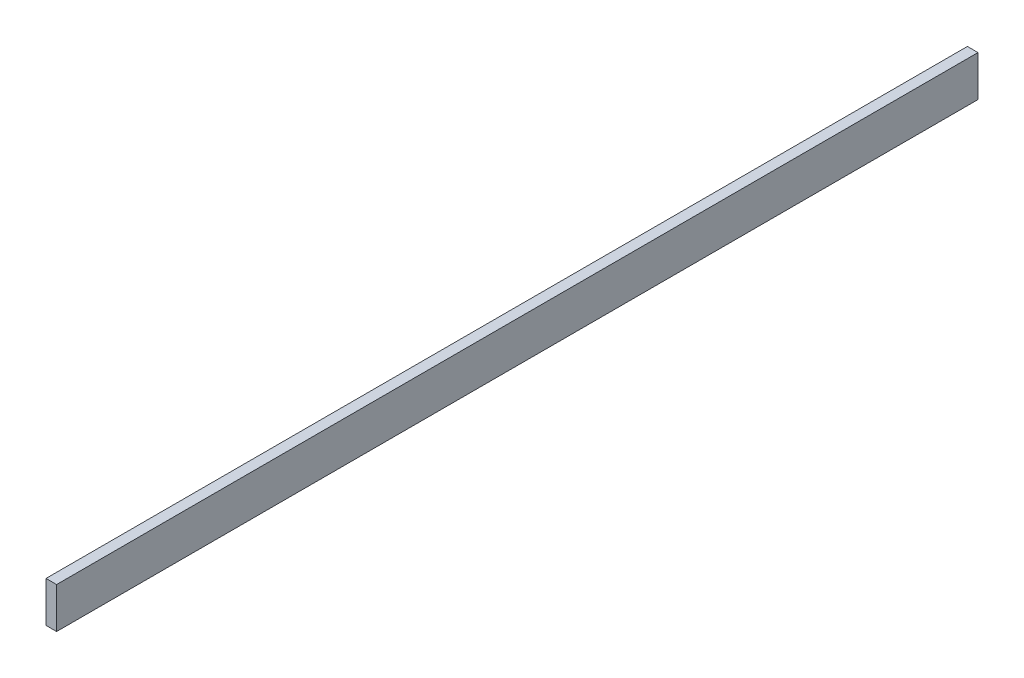
ISO-10303-21;
HEADER;
FILE_DESCRIPTION(('STEP AP214'),'2;1');
FILE_NAME('part.step','',(''),(''),'','','');
FILE_SCHEMA(('AUTOMOTIVE_DESIGN { 1 0 10303 214 1 1 1 1 }'));
ENDSEC;
DATA;
#1=APPLICATION_CONTEXT('core data for automotive mechanical design processes');
#2=APPLICATION_PROTOCOL_DEFINITION('international standard','automotive_design',2000,#1);
#3=PRODUCT_CONTEXT('',#1,'mechanical');
#4=PRODUCT('Part','Part','',(#3));
#5=PRODUCT_RELATED_PRODUCT_CATEGORY('part','',(#4));
#6=PRODUCT_DEFINITION_FORMATION('','',#4);
#7=PRODUCT_DEFINITION_CONTEXT('part definition',#1,'design');
#8=PRODUCT_DEFINITION('design','',#6,#7);
#9=PRODUCT_DEFINITION_SHAPE('','',#8);
#10=(LENGTH_UNIT() NAMED_UNIT(*) SI_UNIT(.MILLI.,.METRE.));
#11=(NAMED_UNIT(*) PLANE_ANGLE_UNIT() SI_UNIT($,.RADIAN.));
#12=(NAMED_UNIT(*) SI_UNIT($,.STERADIAN.) SOLID_ANGLE_UNIT());
#13=UNCERTAINTY_MEASURE_WITH_UNIT(LENGTH_MEASURE(1.E-05),#10,'distance_accuracy_value','');
#14=(GEOMETRIC_REPRESENTATION_CONTEXT(3) GLOBAL_UNCERTAINTY_ASSIGNED_CONTEXT((#13)) GLOBAL_UNIT_ASSIGNED_CONTEXT((#10,
#11,#12)) REPRESENTATION_CONTEXT('',''));
#15=CARTESIAN_POINT('',(0.,0.,0.));
#16=DIRECTION('',(0.,0.,1.));
#17=DIRECTION('',(1.,0.,0.));
#18=AXIS2_PLACEMENT_3D('',#15,#16,#17);
#19=CARTESIAN_POINT('',(3.88578058618805E-13,-364.261978705734,53.0000000000013));
#20=DIRECTION('',(-1.,0.,0.));
#21=DIRECTION('',(0.,0.,1.));
#22=AXIS2_PLACEMENT_3D('',#19,#20,#21);
#23=PLANE('',#22);
#24=DIRECTION('',(0.,1.,0.));
#25=VECTOR('',#24,1.);
#26=CARTESIAN_POINT('',(3.88578058618805E-13,-364.261978705734,53.0000000000013));
#27=LINE('',#26,#25);
#28=CARTESIAN_POINT('',(1.38777878078145E-13,-15.3827145619995,53.0000000000013));
#29=VERTEX_POINT('',#28);
#30=CARTESIAN_POINT('',(1.38777878078145E-13,0.,53.0000000000013));
#31=VERTEX_POINT('',#30);
#32=EDGE_CURVE('E11',#29,#31,#27,.T.);
#33=ORIENTED_EDGE('',*,*,#32,.F.);
#34=DIRECTION('',(0.,0.,1.));
#35=VECTOR('',#34,1.);
#36=CARTESIAN_POINT('',(1.11022302462516E-13,-15.3827145619995,53.0000000000013));
#37=LINE('',#36,#35);
#38=CARTESIAN_POINT('',(0.,-15.3827145619995,401.000000000002));
#39=VERTEX_POINT('',#38);
#40=EDGE_CURVE('E72',#39,#29,#37,.F.);
#41=ORIENTED_EDGE('',*,*,#40,.F.);
#42=DIRECTION('',(0.,1.,0.));
#43=VECTOR('',#42,1.);
#44=CARTESIAN_POINT('',(2.77555756156289E-13,-364.261978705734,401.000000000002));
#45=LINE('',#44,#43);
#46=CARTESIAN_POINT('',(0.,0.,401.000000000002));
#47=VERTEX_POINT('',#46);
#48=EDGE_CURVE('E35',#39,#47,#45,.T.);
#49=ORIENTED_EDGE('',*,*,#48,.T.);
#50=DIRECTION('',(0.,0.,1.));
#51=VECTOR('',#50,1.);
#52=CARTESIAN_POINT('',(1.38777878078145E-13,0.,53.0000000000013));
#53=LINE('',#52,#51);
#54=EDGE_CURVE('E81',#31,#47,#53,.T.);
#55=ORIENTED_EDGE('',*,*,#54,.F.);
#56=EDGE_LOOP('',(#33,#41,#49,#55));
#57=FACE_BOUND('',#56,.T.);
#58=ADVANCED_FACE('F32',(#57),#23,.T.);
#59=CARTESIAN_POINT('',(3.88578058618805E-13,-364.261978705734,53.0000000000013));
#60=DIRECTION('',(0.,0.,1.));
#61=DIRECTION('',(1.,0.,0.));
#62=AXIS2_PLACEMENT_3D('',#59,#60,#61);
#63=PLANE('',#62);
#64=DIRECTION('',(1.,0.,0.));
#65=VECTOR('',#64,1.);
#66=CARTESIAN_POINT('',(4.00000000000014,-15.3827145619995,53.0000000000013));
#67=LINE('',#66,#65);
#68=CARTESIAN_POINT('',(4.00000000000014,-15.3827145619995,53.0000000000013));
#69=VERTEX_POINT('',#68);
#70=EDGE_CURVE('E74',#69,#29,#67,.F.);
#71=ORIENTED_EDGE('',*,*,#70,.T.);
#72=ORIENTED_EDGE('',*,*,#32,.T.);
#73=DIRECTION('',(1.,0.,0.));
#74=VECTOR('',#73,1.);
#75=CARTESIAN_POINT('',(1.38777878078145E-13,0.,53.0000000000013));
#76=LINE('',#75,#74);
#77=CARTESIAN_POINT('',(4.00000000000009,0.,53.0000000000013));
#78=VERTEX_POINT('',#77);
#79=EDGE_CURVE('E96',#31,#78,#76,.T.);
#80=ORIENTED_EDGE('',*,*,#79,.T.);
#81=DIRECTION('',(0.,1.,0.));
#82=VECTOR('',#81,1.);
#83=CARTESIAN_POINT('',(4.00000000000034,-364.261978705734,53.0000000000013));
#84=LINE('',#83,#82);
#85=EDGE_CURVE('E40',#69,#78,#84,.T.);
#86=ORIENTED_EDGE('',*,*,#85,.F.);
#87=EDGE_LOOP('',(#71,#72,#80,#86));
#88=FACE_BOUND('',#87,.T.);
#89=ADVANCED_FACE('F80',(#88),#63,.F.);
#90=CARTESIAN_POINT('',(4.00000000000034,-364.261978705734,53.0000000000013));
#91=DIRECTION('',(-1.,0.,0.));
#92=DIRECTION('',(0.,0.,1.));
#93=AXIS2_PLACEMENT_3D('',#90,#91,#92);
#94=PLANE('',#93);
#95=DIRECTION('',(0.,0.,-1.));
#96=VECTOR('',#95,1.);
#97=CARTESIAN_POINT('',(4.00000000000014,-15.3827145619995,53.0000000000012));
#98=LINE('',#97,#96);
#99=CARTESIAN_POINT('',(4.00000000000009,-15.3827145619995,401.000000000002));
#100=VERTEX_POINT('',#99);
#101=EDGE_CURVE('E48',#100,#69,#98,.T.);
#102=ORIENTED_EDGE('',*,*,#101,.T.);
#103=ORIENTED_EDGE('',*,*,#85,.T.);
#104=DIRECTION('',(0.,0.,1.));
#105=VECTOR('',#104,1.);
#106=CARTESIAN_POINT('',(4.00000000000009,0.,53.0000000000013));
#107=LINE('',#106,#105);
#108=CARTESIAN_POINT('',(4.00000000000006,0.,401.000000000002));
#109=VERTEX_POINT('',#108);
#110=EDGE_CURVE('E90',#78,#109,#107,.T.);
#111=ORIENTED_EDGE('',*,*,#110,.T.);
#112=DIRECTION('',(0.,1.,0.));
#113=VECTOR('',#112,1.);
#114=CARTESIAN_POINT('',(4.00000000000031,-364.261978705734,401.000000000002));
#115=LINE('',#114,#113);
#116=EDGE_CURVE('E98',#100,#109,#115,.T.);
#117=ORIENTED_EDGE('',*,*,#116,.F.);
#118=EDGE_LOOP('',(#102,#103,#111,#117));
#119=FACE_BOUND('',#118,.T.);
#120=ADVANCED_FACE('F104',(#119),#94,.F.);
#121=CARTESIAN_POINT('',(4.00000000000031,-364.261978705734,401.000000000002));
#122=DIRECTION('',(0.,0.,-1.));
#123=DIRECTION('',(-1.,0.,0.));
#124=AXIS2_PLACEMENT_3D('',#121,#122,#123);
#125=PLANE('',#124);
#126=DIRECTION('',(1.,0.,0.));
#127=VECTOR('',#126,1.);
#128=CARTESIAN_POINT('',(4.00000000000009,-15.3827145619995,401.000000000002));
#129=LINE('',#128,#127);
#130=EDGE_CURVE('E75',#100,#39,#129,.F.);
#131=ORIENTED_EDGE('',*,*,#130,.F.);
#132=ORIENTED_EDGE('',*,*,#116,.T.);
#133=DIRECTION('',(-1.,0.,0.));
#134=VECTOR('',#133,1.);
#135=CARTESIAN_POINT('',(4.00000000000006,0.,401.000000000002));
#136=LINE('',#135,#134);
#137=EDGE_CURVE('E88',#109,#47,#136,.T.);
#138=ORIENTED_EDGE('',*,*,#137,.T.);
#139=ORIENTED_EDGE('',*,*,#48,.F.);
#140=EDGE_LOOP('',(#131,#132,#138,#139));
#141=FACE_BOUND('',#140,.T.);
#142=ADVANCED_FACE('F101',(#141),#125,.F.);
#143=CARTESIAN_POINT('',(0.,0.,0.));
#144=DIRECTION('',(0.,-1.,0.));
#145=DIRECTION('',(-1.,0.,0.));
#146=AXIS2_PLACEMENT_3D('',#143,#144,#145);
#147=PLANE('',#146);
#148=ORIENTED_EDGE('',*,*,#54,.T.);
#149=ORIENTED_EDGE('',*,*,#137,.F.);
#150=ORIENTED_EDGE('',*,*,#110,.F.);
#151=ORIENTED_EDGE('',*,*,#79,.F.);
#152=EDGE_LOOP('',(#148,#149,#150,#151));
#153=FACE_BOUND('',#152,.T.);
#154=ADVANCED_FACE('F105',(#153),#147,.F.);
#155=CARTESIAN_POINT('',(4.00000000000014,-15.3827145619995,53.0000000000012));
#156=DIRECTION('',(0.,1.,0.));
#157=DIRECTION('',(0.,0.,-1.));
#158=AXIS2_PLACEMENT_3D('',#155,#156,#157);
#159=PLANE('',#158);
#160=ORIENTED_EDGE('',*,*,#70,.F.);
#161=ORIENTED_EDGE('',*,*,#101,.F.);
#162=ORIENTED_EDGE('',*,*,#130,.T.);
#163=ORIENTED_EDGE('',*,*,#40,.T.);
#164=EDGE_LOOP('',(#160,#161,#162,#163));
#165=FACE_BOUND('',#164,.T.);
#166=ADVANCED_FACE('F73',(#165),#159,.F.);
#167=CLOSED_SHELL('',(#58,#89,#120,#142,#154,#166));
#168=MANIFOLD_SOLID_BREP('B2',#167);
#169=ADVANCED_BREP_SHAPE_REPRESENTATION('',(#18,#168),#14);
#170=SHAPE_DEFINITION_REPRESENTATION(#9,#169);
ENDSEC;
END-ISO-10303-21;
